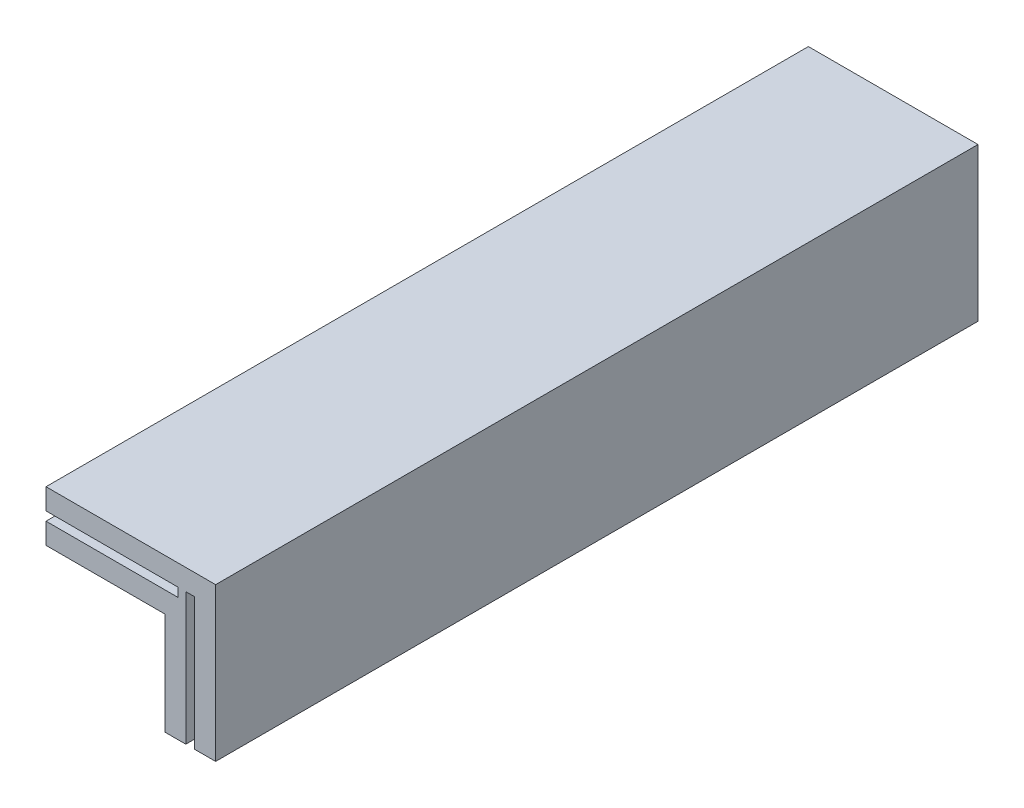
ISO-10303-21;
HEADER;
FILE_DESCRIPTION(('STEP AP214'),'2;1');
FILE_NAME('part.step','',(''),(''),'','','');
FILE_SCHEMA(('AUTOMOTIVE_DESIGN { 1 0 10303 214 1 1 1 1 }'));
ENDSEC;
DATA;
#1=APPLICATION_CONTEXT('core data for automotive mechanical design processes');
#2=APPLICATION_PROTOCOL_DEFINITION('international standard','automotive_design',2000,#1);
#3=PRODUCT_CONTEXT('',#1,'mechanical');
#4=PRODUCT('Part','Part','',(#3));
#5=PRODUCT_RELATED_PRODUCT_CATEGORY('part','',(#4));
#6=PRODUCT_DEFINITION_FORMATION('','',#4);
#7=PRODUCT_DEFINITION_CONTEXT('part definition',#1,'design');
#8=PRODUCT_DEFINITION('design','',#6,#7);
#9=PRODUCT_DEFINITION_SHAPE('','',#8);
#10=(LENGTH_UNIT() NAMED_UNIT(*) SI_UNIT(.MILLI.,.METRE.));
#11=(NAMED_UNIT(*) PLANE_ANGLE_UNIT() SI_UNIT($,.RADIAN.));
#12=(NAMED_UNIT(*) SI_UNIT($,.STERADIAN.) SOLID_ANGLE_UNIT());
#13=UNCERTAINTY_MEASURE_WITH_UNIT(LENGTH_MEASURE(1.E-05),#10,'distance_accuracy_value','');
#14=(GEOMETRIC_REPRESENTATION_CONTEXT(3) GLOBAL_UNCERTAINTY_ASSIGNED_CONTEXT((#13)) GLOBAL_UNIT_ASSIGNED_CONTEXT((#10,
#11,#12)) REPRESENTATION_CONTEXT('',''));
#15=CARTESIAN_POINT('',(0.,0.,0.));
#16=DIRECTION('',(0.,0.,1.));
#17=DIRECTION('',(1.,0.,0.));
#18=AXIS2_PLACEMENT_3D('',#15,#16,#17);
#19=CARTESIAN_POINT('',(-5.675,0.,30.));
#20=DIRECTION('',(-1.,0.,0.));
#21=DIRECTION('',(0.,0.,1.));
#22=AXIS2_PLACEMENT_3D('',#19,#20,#21);
#23=PLANE('',#22);
#24=DIRECTION('',(0.,1.,0.));
#25=VECTOR('',#24,1.);
#26=CARTESIAN_POINT('',(-5.675,0.,0.));
#27=LINE('',#26,#25);
#28=CARTESIAN_POINT('',(-5.675,1.2,0.));
#29=VERTEX_POINT('',#28);
#30=CARTESIAN_POINT('',(-5.675,2.025,0.));
#31=VERTEX_POINT('',#30);
#32=EDGE_CURVE('E179',#29,#31,#27,.T.);
#33=ORIENTED_EDGE('',*,*,#32,.F.);
#34=DIRECTION('',(0.,0.,-1.));
#35=VECTOR('',#34,1.);
#36=CARTESIAN_POINT('',(-5.675,1.2,30.));
#37=LINE('',#36,#35);
#38=CARTESIAN_POINT('',(-5.675,1.2,30.));
#39=VERTEX_POINT('',#38);
#40=EDGE_CURVE('E11',#39,#29,#37,.T.);
#41=ORIENTED_EDGE('',*,*,#40,.F.);
#42=DIRECTION('',(0.,1.,0.));
#43=VECTOR('',#42,1.);
#44=CARTESIAN_POINT('',(-5.675,0.,30.));
#45=LINE('',#44,#43);
#46=CARTESIAN_POINT('',(-5.675,2.025,30.));
#47=VERTEX_POINT('',#46);
#48=EDGE_CURVE('E226',#39,#47,#45,.T.);
#49=ORIENTED_EDGE('',*,*,#48,.T.);
#50=DIRECTION('',(0.,0.,-1.));
#51=VECTOR('',#50,1.);
#52=CARTESIAN_POINT('',(-5.675,2.025,30.));
#53=LINE('',#52,#51);
#54=EDGE_CURVE('E112',#47,#31,#53,.T.);
#55=ORIENTED_EDGE('',*,*,#54,.T.);
#56=EDGE_LOOP('',(#33,#41,#49,#55));
#57=FACE_BOUND('',#56,.T.);
#58=ADVANCED_FACE('F43',(#57),#23,.T.);
#59=CARTESIAN_POINT('',(0.,1.2,30.));
#60=DIRECTION('',(0.,1.,0.));
#61=DIRECTION('',(0.,0.,1.));
#62=AXIS2_PLACEMENT_3D('',#59,#60,#61);
#63=PLANE('',#62);
#64=DIRECTION('',(1.,0.,0.));
#65=VECTOR('',#64,1.);
#66=CARTESIAN_POINT('',(0.,1.2,0.));
#67=LINE('',#66,#65);
#68=CARTESIAN_POINT('',(-0.475,1.2,0.));
#69=VERTEX_POINT('',#68);
#70=EDGE_CURVE('E183',#29,#69,#67,.T.);
#71=ORIENTED_EDGE('',*,*,#70,.T.);
#72=DIRECTION('',(0.,0.,-1.));
#73=VECTOR('',#72,1.);
#74=CARTESIAN_POINT('',(-0.475,1.2,30.));
#75=LINE('',#74,#73);
#76=CARTESIAN_POINT('',(-0.475,1.2,30.));
#77=VERTEX_POINT('',#76);
#78=EDGE_CURVE('E52',#77,#69,#75,.T.);
#79=ORIENTED_EDGE('',*,*,#78,.F.);
#80=DIRECTION('',(1.,0.,0.));
#81=VECTOR('',#80,1.);
#82=CARTESIAN_POINT('',(0.,1.2,30.));
#83=LINE('',#82,#81);
#84=EDGE_CURVE('E281',#39,#77,#83,.T.);
#85=ORIENTED_EDGE('',*,*,#84,.F.);
#86=ORIENTED_EDGE('',*,*,#40,.T.);
#87=EDGE_LOOP('',(#71,#79,#85,#86));
#88=FACE_BOUND('',#87,.T.);
#89=ADVANCED_FACE('F269',(#88),#63,.F.);
#90=CARTESIAN_POINT('',(-0.475,0.,30.));
#91=DIRECTION('',(-1.,0.,0.));
#92=DIRECTION('',(0.,0.,1.));
#93=AXIS2_PLACEMENT_3D('',#90,#91,#92);
#94=PLANE('',#93);
#95=DIRECTION('',(0.,1.,0.));
#96=VECTOR('',#95,1.);
#97=CARTESIAN_POINT('',(-0.475,0.,0.));
#98=LINE('',#97,#96);
#99=CARTESIAN_POINT('',(-0.475,0.85,0.));
#100=VERTEX_POINT('',#99);
#101=EDGE_CURVE('E187',#100,#69,#98,.T.);
#102=ORIENTED_EDGE('',*,*,#101,.F.);
#103=DIRECTION('',(0.,0.,-1.));
#104=VECTOR('',#103,1.);
#105=CARTESIAN_POINT('',(-0.475,0.85,30.));
#106=LINE('',#105,#104);
#107=CARTESIAN_POINT('',(-0.475,0.85,30.));
#108=VERTEX_POINT('',#107);
#109=EDGE_CURVE('E257',#108,#100,#106,.T.);
#110=ORIENTED_EDGE('',*,*,#109,.F.);
#111=DIRECTION('',(0.,1.,0.));
#112=VECTOR('',#111,1.);
#113=CARTESIAN_POINT('',(-0.475,0.,30.));
#114=LINE('',#113,#112);
#115=EDGE_CURVE('E266',#108,#77,#114,.T.);
#116=ORIENTED_EDGE('',*,*,#115,.T.);
#117=ORIENTED_EDGE('',*,*,#78,.T.);
#118=EDGE_LOOP('',(#102,#110,#116,#117));
#119=FACE_BOUND('',#118,.T.);
#120=ADVANCED_FACE('F264',(#119),#94,.T.);
#121=CARTESIAN_POINT('',(0.,0.85,30.));
#122=DIRECTION('',(0.,1.,0.));
#123=DIRECTION('',(0.,0.,1.));
#124=AXIS2_PLACEMENT_3D('',#121,#122,#123);
#125=PLANE('',#124);
#126=DIRECTION('',(1.,0.,0.));
#127=VECTOR('',#126,1.);
#128=CARTESIAN_POINT('',(0.,0.85,0.));
#129=LINE('',#128,#127);
#130=CARTESIAN_POINT('',(-5.675,0.85,0.));
#131=VERTEX_POINT('',#130);
#132=EDGE_CURVE('E191',#131,#100,#129,.T.);
#133=ORIENTED_EDGE('',*,*,#132,.F.);
#134=DIRECTION('',(0.,0.,-1.));
#135=VECTOR('',#134,1.);
#136=CARTESIAN_POINT('',(-5.675,0.85,30.));
#137=LINE('',#136,#135);
#138=CARTESIAN_POINT('',(-5.675,0.85,30.));
#139=VERTEX_POINT('',#138);
#140=EDGE_CURVE('E254',#139,#131,#137,.T.);
#141=ORIENTED_EDGE('',*,*,#140,.F.);
#142=DIRECTION('',(1.,0.,0.));
#143=VECTOR('',#142,1.);
#144=CARTESIAN_POINT('',(0.,0.85,30.));
#145=LINE('',#144,#143);
#146=EDGE_CURVE('E278',#139,#108,#145,.T.);
#147=ORIENTED_EDGE('',*,*,#146,.T.);
#148=ORIENTED_EDGE('',*,*,#109,.T.);
#149=EDGE_LOOP('',(#133,#141,#147,#148));
#150=FACE_BOUND('',#149,.T.);
#151=ADVANCED_FACE('F275',(#150),#125,.T.);
#152=CARTESIAN_POINT('',(-5.675,0.,30.));
#153=DIRECTION('',(-1.,0.,0.));
#154=DIRECTION('',(0.,0.,1.));
#155=AXIS2_PLACEMENT_3D('',#152,#153,#154);
#156=PLANE('',#155);
#157=DIRECTION('',(0.,1.,0.));
#158=VECTOR('',#157,1.);
#159=CARTESIAN_POINT('',(-5.675,0.,0.));
#160=LINE('',#159,#158);
#161=CARTESIAN_POINT('',(-5.675,0.0249999999999996,0.));
#162=VERTEX_POINT('',#161);
#163=EDGE_CURVE('E195',#162,#131,#160,.T.);
#164=ORIENTED_EDGE('',*,*,#163,.F.);
#165=DIRECTION('',(0.,0.,-1.));
#166=VECTOR('',#165,1.);
#167=CARTESIAN_POINT('',(-5.675,0.0249999999999996,30.));
#168=LINE('',#167,#166);
#169=CARTESIAN_POINT('',(-5.675,0.0249999999999996,30.));
#170=VERTEX_POINT('',#169);
#171=EDGE_CURVE('E251',#170,#162,#168,.T.);
#172=ORIENTED_EDGE('',*,*,#171,.F.);
#173=DIRECTION('',(0.,1.,0.));
#174=VECTOR('',#173,1.);
#175=CARTESIAN_POINT('',(-5.675,0.,30.));
#176=LINE('',#175,#174);
#177=EDGE_CURVE('E286',#170,#139,#176,.T.);
#178=ORIENTED_EDGE('',*,*,#177,.T.);
#179=ORIENTED_EDGE('',*,*,#140,.T.);
#180=EDGE_LOOP('',(#164,#172,#178,#179));
#181=FACE_BOUND('',#180,.T.);
#182=ADVANCED_FACE('F325',(#181),#156,.T.);
#183=CARTESIAN_POINT('',(0.,0.0250000000000003,30.));
#184=DIRECTION('',(0.,-1.,0.));
#185=DIRECTION('',(1.,0.,0.));
#186=AXIS2_PLACEMENT_3D('',#183,#184,#185);
#187=PLANE('',#186);
#188=DIRECTION('',(-1.,0.,0.));
#189=VECTOR('',#188,1.);
#190=CARTESIAN_POINT('',(0.,0.0250000000000003,0.));
#191=LINE('',#190,#189);
#192=CARTESIAN_POINT('',(-1.,0.0249999999999999,0.));
#193=VERTEX_POINT('',#192);
#194=EDGE_CURVE('E199',#193,#162,#191,.T.);
#195=ORIENTED_EDGE('',*,*,#194,.F.);
#196=DIRECTION('',(0.,0.,-1.));
#197=VECTOR('',#196,1.);
#198=CARTESIAN_POINT('',(-1.,0.0249999999999999,30.));
#199=LINE('',#198,#197);
#200=CARTESIAN_POINT('',(-1.,0.0249999999999999,30.));
#201=VERTEX_POINT('',#200);
#202=EDGE_CURVE('E248',#201,#193,#199,.T.);
#203=ORIENTED_EDGE('',*,*,#202,.F.);
#204=DIRECTION('',(-1.,0.,0.));
#205=VECTOR('',#204,1.);
#206=CARTESIAN_POINT('',(0.,0.0250000000000003,30.));
#207=LINE('',#206,#205);
#208=EDGE_CURVE('E293',#201,#170,#207,.T.);
#209=ORIENTED_EDGE('',*,*,#208,.T.);
#210=ORIENTED_EDGE('',*,*,#171,.T.);
#211=EDGE_LOOP('',(#195,#203,#209,#210));
#212=FACE_BOUND('',#211,.T.);
#213=ADVANCED_FACE('F328',(#212),#187,.T.);
#214=CARTESIAN_POINT('',(-1.,0.,30.));
#215=DIRECTION('',(1.,0.,0.));
#216=DIRECTION('',(0.,1.,0.));
#217=AXIS2_PLACEMENT_3D('',#214,#215,#216);
#218=PLANE('',#217);
#219=DIRECTION('',(0.,-1.,0.));
#220=VECTOR('',#219,1.);
#221=CARTESIAN_POINT('',(-1.,0.,0.));
#222=LINE('',#221,#220);
#223=CARTESIAN_POINT('',(-1.,-4.,0.));
#224=VERTEX_POINT('',#223);
#225=EDGE_CURVE('E203',#193,#224,#222,.T.);
#226=ORIENTED_EDGE('',*,*,#225,.T.);
#227=DIRECTION('',(0.,0.,-1.));
#228=VECTOR('',#227,1.);
#229=CARTESIAN_POINT('',(-1.,-4.,30.));
#230=LINE('',#229,#228);
#231=CARTESIAN_POINT('',(-1.,-4.,30.));
#232=VERTEX_POINT('',#231);
#233=EDGE_CURVE('E244',#232,#224,#230,.T.);
#234=ORIENTED_EDGE('',*,*,#233,.F.);
#235=DIRECTION('',(0.,-1.,0.));
#236=VECTOR('',#235,1.);
#237=CARTESIAN_POINT('',(-1.,0.,30.));
#238=LINE('',#237,#236);
#239=EDGE_CURVE('E297',#201,#232,#238,.T.);
#240=ORIENTED_EDGE('',*,*,#239,.F.);
#241=ORIENTED_EDGE('',*,*,#202,.T.);
#242=EDGE_LOOP('',(#226,#234,#240,#241));
#243=FACE_BOUND('',#242,.T.);
#244=ADVANCED_FACE('F332',(#243),#218,.F.);
#245=CARTESIAN_POINT('',(0.,-4.,30.));
#246=DIRECTION('',(0.,1.,0.));
#247=DIRECTION('',(0.,0.,1.));
#248=AXIS2_PLACEMENT_3D('',#245,#246,#247);
#249=PLANE('',#248);
#250=DIRECTION('',(1.,0.,0.));
#251=VECTOR('',#250,1.);
#252=CARTESIAN_POINT('',(0.,-4.,0.));
#253=LINE('',#252,#251);
#254=CARTESIAN_POINT('',(-0.175,-4.,0.));
#255=VERTEX_POINT('',#254);
#256=EDGE_CURVE('E206',#224,#255,#253,.T.);
#257=ORIENTED_EDGE('',*,*,#256,.T.);
#258=DIRECTION('',(0.,0.,-1.));
#259=VECTOR('',#258,1.);
#260=CARTESIAN_POINT('',(-0.175,-4.,30.));
#261=LINE('',#260,#259);
#262=CARTESIAN_POINT('',(-0.175,-4.,30.));
#263=VERTEX_POINT('',#262);
#264=EDGE_CURVE('E240',#263,#255,#261,.T.);
#265=ORIENTED_EDGE('',*,*,#264,.F.);
#266=DIRECTION('',(1.,0.,0.));
#267=VECTOR('',#266,1.);
#268=CARTESIAN_POINT('',(0.,-4.,30.));
#269=LINE('',#268,#267);
#270=EDGE_CURVE('E159',#232,#263,#269,.T.);
#271=ORIENTED_EDGE('',*,*,#270,.F.);
#272=ORIENTED_EDGE('',*,*,#233,.T.);
#273=EDGE_LOOP('',(#257,#265,#271,#272));
#274=FACE_BOUND('',#273,.T.);
#275=ADVANCED_FACE('F336',(#274),#249,.F.);
#276=CARTESIAN_POINT('',(-0.175,0.,30.));
#277=DIRECTION('',(-1.,0.,0.));
#278=DIRECTION('',(0.,0.,1.));
#279=AXIS2_PLACEMENT_3D('',#276,#277,#278);
#280=PLANE('',#279);
#281=DIRECTION('',(0.,1.,0.));
#282=VECTOR('',#281,1.);
#283=CARTESIAN_POINT('',(-0.175,0.,0.));
#284=LINE('',#283,#282);
#285=CARTESIAN_POINT('',(-0.175,1.2,0.));
#286=VERTEX_POINT('',#285);
#287=EDGE_CURVE('E209',#255,#286,#284,.T.);
#288=ORIENTED_EDGE('',*,*,#287,.T.);
#289=DIRECTION('',(0.,0.,-1.));
#290=VECTOR('',#289,1.);
#291=CARTESIAN_POINT('',(-0.175,1.2,30.));
#292=LINE('',#291,#290);
#293=CARTESIAN_POINT('',(-0.175,1.2,30.));
#294=VERTEX_POINT('',#293);
#295=EDGE_CURVE('E236',#294,#286,#292,.T.);
#296=ORIENTED_EDGE('',*,*,#295,.F.);
#297=DIRECTION('',(0.,1.,0.));
#298=VECTOR('',#297,1.);
#299=CARTESIAN_POINT('',(-0.175,0.,30.));
#300=LINE('',#299,#298);
#301=EDGE_CURVE('E301',#263,#294,#300,.T.);
#302=ORIENTED_EDGE('',*,*,#301,.F.);
#303=ORIENTED_EDGE('',*,*,#264,.T.);
#304=EDGE_LOOP('',(#288,#296,#302,#303));
#305=FACE_BOUND('',#304,.T.);
#306=ADVANCED_FACE('F338',(#305),#280,.F.);
#307=CARTESIAN_POINT('',(0.,1.2,30.));
#308=DIRECTION('',(0.,1.,0.));
#309=DIRECTION('',(0.,0.,1.));
#310=AXIS2_PLACEMENT_3D('',#307,#308,#309);
#311=PLANE('',#310);
#312=DIRECTION('',(1.,0.,0.));
#313=VECTOR('',#312,1.);
#314=CARTESIAN_POINT('',(0.,1.2,0.));
#315=LINE('',#314,#313);
#316=CARTESIAN_POINT('',(0.175,1.2,0.));
#317=VERTEX_POINT('',#316);
#318=EDGE_CURVE('E212',#286,#317,#315,.T.);
#319=ORIENTED_EDGE('',*,*,#318,.T.);
#320=DIRECTION('',(0.,0.,-1.));
#321=VECTOR('',#320,1.);
#322=CARTESIAN_POINT('',(0.175,1.2,30.));
#323=LINE('',#322,#321);
#324=CARTESIAN_POINT('',(0.175,1.2,30.));
#325=VERTEX_POINT('',#324);
#326=EDGE_CURVE('E233',#325,#317,#323,.T.);
#327=ORIENTED_EDGE('',*,*,#326,.F.);
#328=DIRECTION('',(1.,0.,0.));
#329=VECTOR('',#328,1.);
#330=CARTESIAN_POINT('',(0.,1.2,30.));
#331=LINE('',#330,#329);
#332=EDGE_CURVE('E303',#294,#325,#331,.T.);
#333=ORIENTED_EDGE('',*,*,#332,.F.);
#334=ORIENTED_EDGE('',*,*,#295,.T.);
#335=EDGE_LOOP('',(#319,#327,#333,#334));
#336=FACE_BOUND('',#335,.T.);
#337=ADVANCED_FACE('F341',(#336),#311,.F.);
#338=CARTESIAN_POINT('',(0.175,0.,30.));
#339=DIRECTION('',(-1.,0.,0.));
#340=DIRECTION('',(0.,0.,1.));
#341=AXIS2_PLACEMENT_3D('',#338,#339,#340);
#342=PLANE('',#341);
#343=DIRECTION('',(0.,1.,0.));
#344=VECTOR('',#343,1.);
#345=CARTESIAN_POINT('',(0.175,0.,0.));
#346=LINE('',#345,#344);
#347=CARTESIAN_POINT('',(0.175,-4.,0.));
#348=VERTEX_POINT('',#347);
#349=EDGE_CURVE('E216',#348,#317,#346,.T.);
#350=ORIENTED_EDGE('',*,*,#349,.F.);
#351=DIRECTION('',(0.,0.,-1.));
#352=VECTOR('',#351,1.);
#353=CARTESIAN_POINT('',(0.175,-4.,30.));
#354=LINE('',#353,#352);
#355=CARTESIAN_POINT('',(0.175,-4.,30.));
#356=VERTEX_POINT('',#355);
#357=EDGE_CURVE('E169',#356,#348,#354,.T.);
#358=ORIENTED_EDGE('',*,*,#357,.F.);
#359=DIRECTION('',(0.,1.,0.));
#360=VECTOR('',#359,1.);
#361=CARTESIAN_POINT('',(0.175,0.,30.));
#362=LINE('',#361,#360);
#363=EDGE_CURVE('E155',#356,#325,#362,.T.);
#364=ORIENTED_EDGE('',*,*,#363,.T.);
#365=ORIENTED_EDGE('',*,*,#326,.T.);
#366=EDGE_LOOP('',(#350,#358,#364,#365));
#367=FACE_BOUND('',#366,.T.);
#368=ADVANCED_FACE('F310',(#367),#342,.T.);
#369=CARTESIAN_POINT('',(1.,-4.,0.));
#370=VERTEX_POINT('',#369);
#371=EDGE_CURVE('E164',#348,#370,#253,.T.);
#372=ORIENTED_EDGE('',*,*,#371,.T.);
#373=DIRECTION('',(0.,0.,-1.));
#374=VECTOR('',#373,1.);
#375=CARTESIAN_POINT('',(1.,-4.,30.));
#376=LINE('',#375,#374);
#377=CARTESIAN_POINT('',(1.,-4.,30.));
#378=VERTEX_POINT('',#377);
#379=EDGE_CURVE('E161',#378,#370,#376,.T.);
#380=ORIENTED_EDGE('',*,*,#379,.F.);
#381=EDGE_CURVE('E149',#356,#378,#269,.T.);
#382=ORIENTED_EDGE('',*,*,#381,.F.);
#383=ORIENTED_EDGE('',*,*,#357,.T.);
#384=EDGE_LOOP('',(#372,#380,#382,#383));
#385=FACE_BOUND('',#384,.T.);
#386=ADVANCED_FACE('F162',(#385),#249,.F.);
#387=CARTESIAN_POINT('',(1.,0.,30.));
#388=DIRECTION('',(1.,0.,0.));
#389=DIRECTION('',(0.,1.,0.));
#390=AXIS2_PLACEMENT_3D('',#387,#388,#389);
#391=PLANE('',#390);
#392=DIRECTION('',(0.,-1.,0.));
#393=VECTOR('',#392,1.);
#394=CARTESIAN_POINT('',(1.,0.,0.));
#395=LINE('',#394,#393);
#396=CARTESIAN_POINT('',(1.,2.025,0.));
#397=VERTEX_POINT('',#396);
#398=EDGE_CURVE('E220',#397,#370,#395,.T.);
#399=ORIENTED_EDGE('',*,*,#398,.F.);
#400=DIRECTION('',(0.,0.,-1.));
#401=VECTOR('',#400,1.);
#402=CARTESIAN_POINT('',(1.,2.025,30.));
#403=LINE('',#402,#401);
#404=CARTESIAN_POINT('',(1.,2.025,30.));
#405=VERTEX_POINT('',#404);
#406=EDGE_CURVE('E105',#405,#397,#403,.T.);
#407=ORIENTED_EDGE('',*,*,#406,.F.);
#408=DIRECTION('',(0.,-1.,0.));
#409=VECTOR('',#408,1.);
#410=CARTESIAN_POINT('',(1.,0.,30.));
#411=LINE('',#410,#409);
#412=EDGE_CURVE('E153',#405,#378,#411,.T.);
#413=ORIENTED_EDGE('',*,*,#412,.T.);
#414=ORIENTED_EDGE('',*,*,#379,.T.);
#415=EDGE_LOOP('',(#399,#407,#413,#414));
#416=FACE_BOUND('',#415,.T.);
#417=ADVANCED_FACE('F171',(#416),#391,.T.);
#418=CARTESIAN_POINT('',(0.,2.025,30.));
#419=DIRECTION('',(0.,-1.,0.));
#420=DIRECTION('',(1.,0.,0.));
#421=AXIS2_PLACEMENT_3D('',#418,#419,#420);
#422=PLANE('',#421);
#423=DIRECTION('',(-1.,0.,0.));
#424=VECTOR('',#423,1.);
#425=CARTESIAN_POINT('',(0.,2.025,0.));
#426=LINE('',#425,#424);
#427=EDGE_CURVE('E223',#397,#31,#426,.T.);
#428=ORIENTED_EDGE('',*,*,#427,.T.);
#429=ORIENTED_EDGE('',*,*,#54,.F.);
#430=DIRECTION('',(-1.,0.,0.));
#431=VECTOR('',#430,1.);
#432=CARTESIAN_POINT('',(0.,2.025,30.));
#433=LINE('',#432,#431);
#434=EDGE_CURVE('E60',#405,#47,#433,.T.);
#435=ORIENTED_EDGE('',*,*,#434,.F.);
#436=ORIENTED_EDGE('',*,*,#406,.T.);
#437=EDGE_LOOP('',(#428,#429,#435,#436));
#438=FACE_BOUND('',#437,.T.);
#439=ADVANCED_FACE('F352',(#438),#422,.F.);
#440=CARTESIAN_POINT('',(0.,0.,30.));
#441=DIRECTION('',(0.,0.,1.));
#442=DIRECTION('',(1.,0.,0.));
#443=AXIS2_PLACEMENT_3D('',#440,#441,#442);
#444=PLANE('',#443);
#445=ORIENTED_EDGE('',*,*,#48,.F.);
#446=ORIENTED_EDGE('',*,*,#84,.T.);
#447=ORIENTED_EDGE('',*,*,#115,.F.);
#448=ORIENTED_EDGE('',*,*,#146,.F.);
#449=ORIENTED_EDGE('',*,*,#177,.F.);
#450=ORIENTED_EDGE('',*,*,#208,.F.);
#451=ORIENTED_EDGE('',*,*,#239,.T.);
#452=ORIENTED_EDGE('',*,*,#270,.T.);
#453=ORIENTED_EDGE('',*,*,#301,.T.);
#454=ORIENTED_EDGE('',*,*,#332,.T.);
#455=ORIENTED_EDGE('',*,*,#363,.F.);
#456=ORIENTED_EDGE('',*,*,#381,.T.);
#457=ORIENTED_EDGE('',*,*,#412,.F.);
#458=ORIENTED_EDGE('',*,*,#434,.T.);
#459=EDGE_LOOP('',(#445,#446,#447,#448,#449,#450,#451,#452,#453,#454,#455,#456,#457,#458));
#460=FACE_BOUND('',#459,.T.);
#461=ADVANCED_FACE('F151',(#460),#444,.T.);
#462=CARTESIAN_POINT('',(0.,0.,0.));
#463=DIRECTION('',(0.,0.,1.));
#464=DIRECTION('',(1.,0.,0.));
#465=AXIS2_PLACEMENT_3D('',#462,#463,#464);
#466=PLANE('',#465);
#467=ORIENTED_EDGE('',*,*,#32,.T.);
#468=ORIENTED_EDGE('',*,*,#427,.F.);
#469=ORIENTED_EDGE('',*,*,#398,.T.);
#470=ORIENTED_EDGE('',*,*,#371,.F.);
#471=ORIENTED_EDGE('',*,*,#349,.T.);
#472=ORIENTED_EDGE('',*,*,#318,.F.);
#473=ORIENTED_EDGE('',*,*,#287,.F.);
#474=ORIENTED_EDGE('',*,*,#256,.F.);
#475=ORIENTED_EDGE('',*,*,#225,.F.);
#476=ORIENTED_EDGE('',*,*,#194,.T.);
#477=ORIENTED_EDGE('',*,*,#163,.T.);
#478=ORIENTED_EDGE('',*,*,#132,.T.);
#479=ORIENTED_EDGE('',*,*,#101,.T.);
#480=ORIENTED_EDGE('',*,*,#70,.F.);
#481=EDGE_LOOP('',(#467,#468,#469,#470,#471,#472,#473,#474,#475,#476,#477,#478,#479,#480));
#482=FACE_BOUND('',#481,.T.);
#483=ADVANCED_FACE('F271',(#482),#466,.F.);
#484=CLOSED_SHELL('',(#58,#89,#120,#151,#182,#213,#244,#275,#306,#337,#368,#386,#417,#439,#461,#483));
#485=MANIFOLD_SOLID_BREP('B2',#484);
#486=ADVANCED_BREP_SHAPE_REPRESENTATION('',(#18,#485),#14);
#487=SHAPE_DEFINITION_REPRESENTATION(#9,#486);
ENDSEC;
END-ISO-10303-21;
